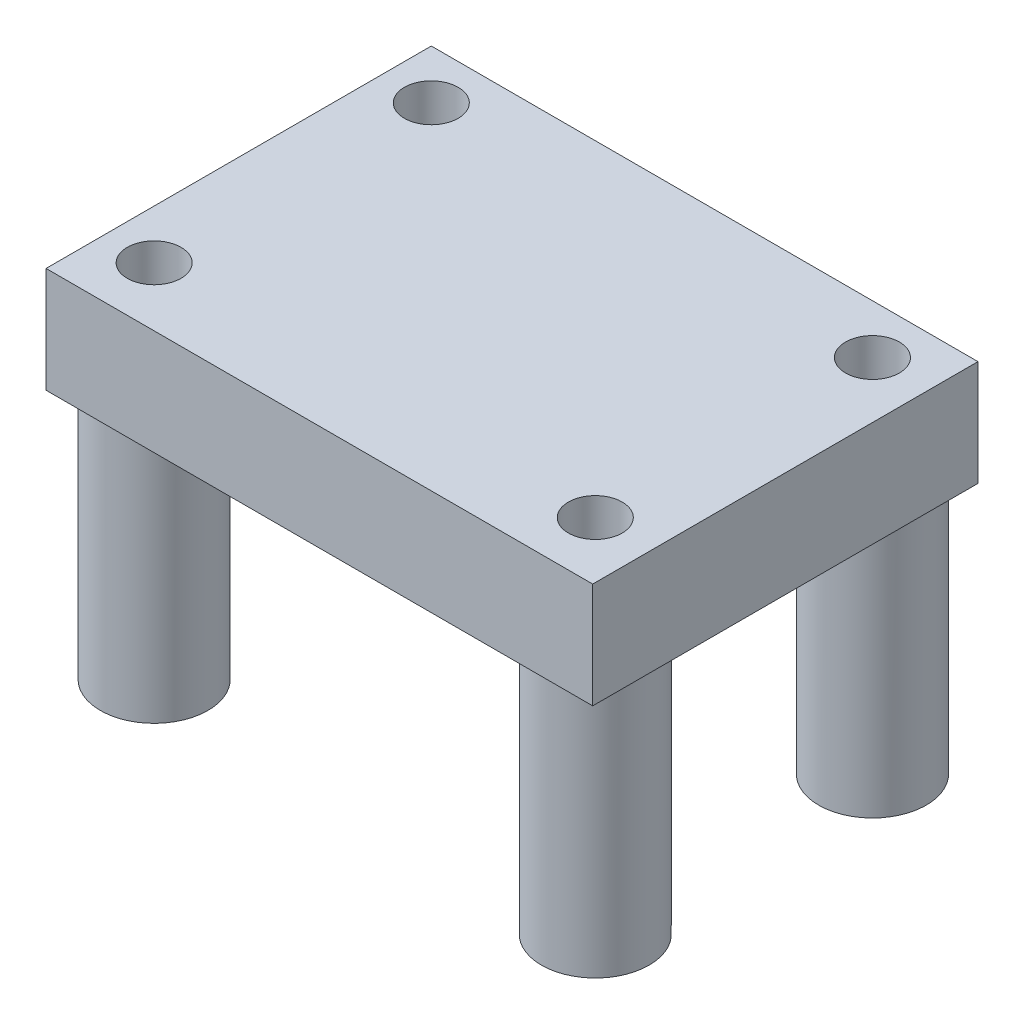
ISO-10303-21;
HEADER;
FILE_DESCRIPTION(('STEP AP214'),'2;1');
FILE_NAME('part.step','',(''),(''),'','','');
FILE_SCHEMA(('AUTOMOTIVE_DESIGN { 1 0 10303 214 1 1 1 1 }'));
ENDSEC;
DATA;
#1=APPLICATION_CONTEXT('core data for automotive mechanical design processes');
#2=APPLICATION_PROTOCOL_DEFINITION('international standard','automotive_design',2000,#1);
#3=PRODUCT_CONTEXT('',#1,'mechanical');
#4=PRODUCT('Part','Part','',(#3));
#5=PRODUCT_RELATED_PRODUCT_CATEGORY('part','',(#4));
#6=PRODUCT_DEFINITION_FORMATION('','',#4);
#7=PRODUCT_DEFINITION_CONTEXT('part definition',#1,'design');
#8=PRODUCT_DEFINITION('design','',#6,#7);
#9=PRODUCT_DEFINITION_SHAPE('','',#8);
#10=(LENGTH_UNIT() NAMED_UNIT(*) SI_UNIT(.MILLI.,.METRE.));
#11=(NAMED_UNIT(*) PLANE_ANGLE_UNIT() SI_UNIT($,.RADIAN.));
#12=(NAMED_UNIT(*) SI_UNIT($,.STERADIAN.) SOLID_ANGLE_UNIT());
#13=UNCERTAINTY_MEASURE_WITH_UNIT(LENGTH_MEASURE(1.E-05),#10,'distance_accuracy_value','');
#14=(GEOMETRIC_REPRESENTATION_CONTEXT(3) GLOBAL_UNCERTAINTY_ASSIGNED_CONTEXT((#13)) GLOBAL_UNIT_ASSIGNED_CONTEXT((#10,
#11,#12)) REPRESENTATION_CONTEXT('',''));
#15=CARTESIAN_POINT('',(0.,0.,0.));
#16=DIRECTION('',(0.,0.,1.));
#17=DIRECTION('',(1.,0.,0.));
#18=AXIS2_PLACEMENT_3D('',#15,#16,#17);
#19=CARTESIAN_POINT('',(0.,0.,0.));
#20=DIRECTION('',(0.,1.,0.));
#21=DIRECTION('',(0.,0.,1.));
#22=AXIS2_PLACEMENT_3D('',#19,#20,#21);
#23=PLANE('',#22);
#24=CARTESIAN_POINT('',(-14.5779448621554,0.,-9.19005739348371));
#25=DIRECTION('',(0.,1.,0.));
#26=DIRECTION('',(0.,0.,1.));
#27=AXIS2_PLACEMENT_3D('',#24,#25,#26);
#28=CIRCLE('',#27,2.5);
#29=CARTESIAN_POINT('',(-16.8639448621554,0.,-10.2020870373183));
#30=VERTEX_POINT('',#29);
#31=CARTESIAN_POINT('',(-15.58997450599,0.,-11.4760573934837));
#32=VERTEX_POINT('',#31);
#33=EDGE_CURVE('E11',#30,#32,#28,.F.);
#34=ORIENTED_EDGE('',*,*,#33,.F.);
#35=DIRECTION('',(0.,0.,1.));
#36=VECTOR('',#35,1.);
#37=CARTESIAN_POINT('',(-16.8639448621554,0.,-11.4760573934837));
#38=LINE('',#37,#36);
#39=CARTESIAN_POINT('',(-16.8639448621554,0.,-11.4760573934837));
#40=VERTEX_POINT('',#39);
#41=EDGE_CURVE('E107',#40,#30,#38,.T.);
#42=ORIENTED_EDGE('',*,*,#41,.F.);
#43=DIRECTION('',(-1.,0.,0.));
#44=VECTOR('',#43,1.);
#45=CARTESIAN_POINT('',(-16.8639448621554,0.,-11.4760573934837));
#46=LINE('',#45,#44);
#47=EDGE_CURVE('E51',#32,#40,#46,.T.);
#48=ORIENTED_EDGE('',*,*,#47,.F.);
#49=EDGE_LOOP('',(#34,#42,#48));
#50=FACE_BOUND('',#49,.T.);
#51=ADVANCED_FACE('F36',(#50),#23,.F.);
#52=CARTESIAN_POINT('',(-16.8639448621554,4.9022,-11.4760573934837));
#53=DIRECTION('',(1.,0.,0.));
#54=DIRECTION('',(0.,0.,-1.));
#55=AXIS2_PLACEMENT_3D('',#52,#53,#54);
#56=PLANE('',#55);
#57=ORIENTED_EDGE('',*,*,#41,.T.);
#58=CARTESIAN_POINT('',(-16.8639448621554,0.,-8.1780277496491));
#59=VERTEX_POINT('',#58);
#60=EDGE_CURVE('E103',#30,#59,#38,.T.);
#61=ORIENTED_EDGE('',*,*,#60,.T.);
#62=CARTESIAN_POINT('',(-16.8639448621554,0.,2.67571296268168));
#63=VERTEX_POINT('',#62);
#64=EDGE_CURVE('E104',#59,#63,#38,.T.);
#65=ORIENTED_EDGE('',*,*,#64,.T.);
#66=CARTESIAN_POINT('',(-16.8639448621554,0.,4.6997722503509));
#67=VERTEX_POINT('',#66);
#68=EDGE_CURVE('E119',#63,#67,#38,.T.);
#69=ORIENTED_EDGE('',*,*,#68,.T.);
#70=CARTESIAN_POINT('',(-16.8639448621554,0.,6.42394260651629));
#71=VERTEX_POINT('',#70);
#72=EDGE_CURVE('E112',#67,#71,#38,.T.);
#73=ORIENTED_EDGE('',*,*,#72,.T.);
#74=DIRECTION('',(0.,-1.,0.));
#75=VECTOR('',#74,1.);
#76=CARTESIAN_POINT('',(-16.8639448621554,4.9022,6.42394260651629));
#77=LINE('',#76,#75);
#78=CARTESIAN_POINT('',(-16.8639448621554,4.9022,6.42394260651629));
#79=VERTEX_POINT('',#78);
#80=EDGE_CURVE('E180',#79,#71,#77,.T.);
#81=ORIENTED_EDGE('',*,*,#80,.F.);
#82=DIRECTION('',(0.,0.,1.));
#83=VECTOR('',#82,1.);
#84=CARTESIAN_POINT('',(-16.8639448621554,4.9022,-11.4760573934837));
#85=LINE('',#84,#83);
#86=CARTESIAN_POINT('',(-16.8639448621554,4.9022,-11.4760573934837));
#87=VERTEX_POINT('',#86);
#88=EDGE_CURVE('E155',#87,#79,#85,.T.);
#89=ORIENTED_EDGE('',*,*,#88,.F.);
#90=DIRECTION('',(0.,-1.,0.));
#91=VECTOR('',#90,1.);
#92=CARTESIAN_POINT('',(-16.8639448621554,4.9022,-11.4760573934837));
#93=LINE('',#92,#91);
#94=EDGE_CURVE('E164',#87,#40,#93,.T.);
#95=ORIENTED_EDGE('',*,*,#94,.T.);
#96=EDGE_LOOP('',(#57,#61,#65,#69,#73,#81,#89,#95));
#97=FACE_BOUND('',#96,.T.);
#98=ADVANCED_FACE('F38',(#97),#56,.F.);
#99=CARTESIAN_POINT('',(-16.8639448621554,4.9022,6.42394260651629));
#100=DIRECTION('',(0.,0.,-1.));
#101=DIRECTION('',(-1.,0.,0.));
#102=AXIS2_PLACEMENT_3D('',#99,#100,#101);
#103=PLANE('',#102);
#104=DIRECTION('',(1.,0.,0.));
#105=VECTOR('',#104,1.);
#106=CARTESIAN_POINT('',(-16.8639448621554,0.,6.42394260651629));
#107=LINE('',#106,#105);
#108=CARTESIAN_POINT('',(8.53605513784461,0.,6.42394260651629));
#109=VERTEX_POINT('',#108);
#110=EDGE_CURVE('E166',#71,#109,#107,.T.);
#111=ORIENTED_EDGE('',*,*,#110,.T.);
#112=DIRECTION('',(0.,-1.,0.));
#113=VECTOR('',#112,1.);
#114=CARTESIAN_POINT('',(8.53605513784461,4.9022,6.42394260651629));
#115=LINE('',#114,#113);
#116=CARTESIAN_POINT('',(8.53605513784461,4.9022,6.42394260651629));
#117=VERTEX_POINT('',#116);
#118=EDGE_CURVE('E177',#117,#109,#115,.T.);
#119=ORIENTED_EDGE('',*,*,#118,.F.);
#120=DIRECTION('',(1.,0.,0.));
#121=VECTOR('',#120,1.);
#122=CARTESIAN_POINT('',(-16.8639448621554,4.9022,6.42394260651629));
#123=LINE('',#122,#121);
#124=EDGE_CURVE('E158',#79,#117,#123,.T.);
#125=ORIENTED_EDGE('',*,*,#124,.F.);
#126=ORIENTED_EDGE('',*,*,#80,.T.);
#127=EDGE_LOOP('',(#111,#119,#125,#126));
#128=FACE_BOUND('',#127,.T.);
#129=ADVANCED_FACE('F197',(#128),#103,.F.);
#130=CARTESIAN_POINT('',(8.53605513784461,4.9022,-11.4760573934837));
#131=DIRECTION('',(-1.,0.,0.));
#132=DIRECTION('',(0.,0.,1.));
#133=AXIS2_PLACEMENT_3D('',#130,#131,#132);
#134=PLANE('',#133);
#135=DIRECTION('',(0.,0.,-1.));
#136=VECTOR('',#135,1.);
#137=CARTESIAN_POINT('',(8.53605513784461,0.,-11.4760573934837));
#138=LINE('',#137,#136);
#139=CARTESIAN_POINT('',(8.53605513784461,0.,-11.4760573934837));
#140=VERTEX_POINT('',#139);
#141=EDGE_CURVE('E168',#109,#140,#138,.T.);
#142=ORIENTED_EDGE('',*,*,#141,.T.);
#143=DIRECTION('',(0.,-1.,0.));
#144=VECTOR('',#143,1.);
#145=CARTESIAN_POINT('',(8.53605513784461,4.9022,-11.4760573934837));
#146=LINE('',#145,#144);
#147=CARTESIAN_POINT('',(8.53605513784461,4.9022,-11.4760573934837));
#148=VERTEX_POINT('',#147);
#149=EDGE_CURVE('E174',#148,#140,#146,.T.);
#150=ORIENTED_EDGE('',*,*,#149,.F.);
#151=DIRECTION('',(0.,0.,-1.));
#152=VECTOR('',#151,1.);
#153=CARTESIAN_POINT('',(8.53605513784461,4.9022,-11.4760573934837));
#154=LINE('',#153,#152);
#155=EDGE_CURVE('E161',#117,#148,#154,.T.);
#156=ORIENTED_EDGE('',*,*,#155,.F.);
#157=ORIENTED_EDGE('',*,*,#118,.T.);
#158=EDGE_LOOP('',(#142,#150,#156,#157));
#159=FACE_BOUND('',#158,.T.);
#160=ADVANCED_FACE('F224',(#159),#134,.F.);
#161=CARTESIAN_POINT('',(-16.8639448621554,4.9022,-11.4760573934837));
#162=DIRECTION('',(0.,0.,1.));
#163=DIRECTION('',(1.,0.,0.));
#164=AXIS2_PLACEMENT_3D('',#161,#162,#163);
#165=PLANE('',#164);
#166=CARTESIAN_POINT('',(6.93188478167921,0.,-11.4760573934837));
#167=VERTEX_POINT('',#166);
#168=EDGE_CURVE('E159',#140,#167,#46,.T.);
#169=ORIENTED_EDGE('',*,*,#168,.T.);
#170=CARTESIAN_POINT('',(4.90782549401,0.,-11.4760573934837));
#171=VERTEX_POINT('',#170);
#172=EDGE_CURVE('E172',#167,#171,#46,.T.);
#173=ORIENTED_EDGE('',*,*,#172,.T.);
#174=CARTESIAN_POINT('',(-13.5659152183208,0.,-11.4760573934837));
#175=VERTEX_POINT('',#174);
#176=EDGE_CURVE('E315',#171,#175,#46,.T.);
#177=ORIENTED_EDGE('',*,*,#176,.T.);
#178=EDGE_CURVE('E318',#175,#32,#46,.T.);
#179=ORIENTED_EDGE('',*,*,#178,.T.);
#180=ORIENTED_EDGE('',*,*,#47,.T.);
#181=ORIENTED_EDGE('',*,*,#94,.F.);
#182=DIRECTION('',(-1.,0.,0.));
#183=VECTOR('',#182,1.);
#184=CARTESIAN_POINT('',(-16.8639448621554,4.9022,-11.4760573934837));
#185=LINE('',#184,#183);
#186=EDGE_CURVE('E163',#148,#87,#185,.T.);
#187=ORIENTED_EDGE('',*,*,#186,.F.);
#188=ORIENTED_EDGE('',*,*,#149,.T.);
#189=EDGE_LOOP('',(#169,#173,#177,#179,#180,#181,#187,#188));
#190=FACE_BOUND('',#189,.T.);
#191=ADVANCED_FACE('F219',(#190),#165,.F.);
#192=CARTESIAN_POINT('',(0.,4.9022,0.));
#193=DIRECTION('',(0.,1.,0.));
#194=DIRECTION('',(0.,0.,1.));
#195=AXIS2_PLACEMENT_3D('',#192,#193,#194);
#196=PLANE('',#195);
#197=CARTESIAN_POINT('',(5.91985513784461,4.9022,3.68774260651629));
#198=DIRECTION('',(0.,-1.,0.));
#199=DIRECTION('',(0.,0.,-1.));
#200=AXIS2_PLACEMENT_3D('',#197,#198,#199);
#201=CIRCLE('',#200,1.25);
#202=CARTESIAN_POINT('',(5.91985513784461,4.9022,2.43774260651629));
#203=VERTEX_POINT('',#202);
#204=EDGE_CURVE('E300',#203,#203,#201,.T.);
#205=ORIENTED_EDGE('',*,*,#204,.T.);
#206=EDGE_LOOP('',(#205));
#207=FACE_BOUND('',#206,.T.);
#208=CARTESIAN_POINT('',(5.91985513784461,4.9022,-9.19005739348371));
#209=DIRECTION('',(0.,-1.,0.));
#210=DIRECTION('',(0.,0.,-1.));
#211=AXIS2_PLACEMENT_3D('',#208,#209,#210);
#212=CIRCLE('',#211,1.25);
#213=CARTESIAN_POINT('',(5.91985513784461,4.9022,-10.4400573934837));
#214=VERTEX_POINT('',#213);
#215=EDGE_CURVE('E294',#214,#214,#212,.T.);
#216=ORIENTED_EDGE('',*,*,#215,.T.);
#217=EDGE_LOOP('',(#216));
#218=FACE_BOUND('',#217,.T.);
#219=CARTESIAN_POINT('',(-14.5779448621554,4.9022,-9.19005739348371));
#220=DIRECTION('',(0.,-1.,0.));
#221=DIRECTION('',(0.,0.,-1.));
#222=AXIS2_PLACEMENT_3D('',#219,#220,#221);
#223=CIRCLE('',#222,1.25);
#224=CARTESIAN_POINT('',(-14.5779448621554,4.9022,-10.4400573934837));
#225=VERTEX_POINT('',#224);
#226=EDGE_CURVE('E283',#225,#225,#223,.T.);
#227=ORIENTED_EDGE('',*,*,#226,.T.);
#228=EDGE_LOOP('',(#227));
#229=FACE_BOUND('',#228,.T.);
#230=CARTESIAN_POINT('',(-14.5779448621554,4.9022,3.68774260651629));
#231=DIRECTION('',(0.,-1.,0.));
#232=DIRECTION('',(0.,0.,-1.));
#233=AXIS2_PLACEMENT_3D('',#230,#231,#232);
#234=CIRCLE('',#233,1.25);
#235=CARTESIAN_POINT('',(-14.5779448621554,4.9022,2.43774260651629));
#236=VERTEX_POINT('',#235);
#237=EDGE_CURVE('E136',#236,#236,#234,.T.);
#238=ORIENTED_EDGE('',*,*,#237,.T.);
#239=EDGE_LOOP('',(#238));
#240=FACE_BOUND('',#239,.T.);
#241=ORIENTED_EDGE('',*,*,#88,.T.);
#242=ORIENTED_EDGE('',*,*,#124,.T.);
#243=ORIENTED_EDGE('',*,*,#155,.T.);
#244=ORIENTED_EDGE('',*,*,#186,.T.);
#245=EDGE_LOOP('',(#241,#242,#243,#244));
#246=FACE_BOUND('',#245,.T.);
#247=ADVANCED_FACE('F200',(#207,#218,#229,#240,#246),#196,.T.);
#248=CARTESIAN_POINT('',(-14.5779448621554,0.,-9.19005739348371));
#249=DIRECTION('',(0.,-1.,0.));
#250=DIRECTION('',(0.,0.,-1.));
#251=AXIS2_PLACEMENT_3D('',#248,#249,#250);
#252=CIRCLE('',#251,2.5);
#253=EDGE_CURVE('E59',#175,#59,#252,.T.);
#254=ORIENTED_EDGE('',*,*,#253,.F.);
#255=ORIENTED_EDGE('',*,*,#176,.F.);
#256=CARTESIAN_POINT('',(5.91985513784461,0.,-9.19005739348371));
#257=DIRECTION('',(0.,-1.,0.));
#258=DIRECTION('',(0.,0.,-1.));
#259=AXIS2_PLACEMENT_3D('',#256,#257,#258);
#260=CIRCLE('',#259,2.5);
#261=EDGE_CURVE('E143',#167,#171,#260,.T.);
#262=ORIENTED_EDGE('',*,*,#261,.F.);
#263=ORIENTED_EDGE('',*,*,#168,.F.);
#264=ORIENTED_EDGE('',*,*,#141,.F.);
#265=ORIENTED_EDGE('',*,*,#110,.F.);
#266=ORIENTED_EDGE('',*,*,#72,.F.);
#267=CARTESIAN_POINT('',(-14.5779448621554,0.,3.68774260651629));
#268=DIRECTION('',(0.,-1.,0.));
#269=DIRECTION('',(0.,0.,-1.));
#270=AXIS2_PLACEMENT_3D('',#267,#268,#269);
#271=CIRCLE('',#270,2.5);
#272=EDGE_CURVE('E117',#63,#67,#271,.T.);
#273=ORIENTED_EDGE('',*,*,#272,.F.);
#274=ORIENTED_EDGE('',*,*,#64,.F.);
#275=EDGE_LOOP('',(#254,#255,#262,#263,#264,#265,#266,#273,#274));
#276=FACE_BOUND('',#275,.T.);
#277=CARTESIAN_POINT('',(5.91985513784461,0.,3.68774260651629));
#278=DIRECTION('',(0.,1.,0.));
#279=DIRECTION('',(0.,0.,1.));
#280=AXIS2_PLACEMENT_3D('',#277,#278,#279);
#281=CIRCLE('',#280,2.5);
#282=CARTESIAN_POINT('',(5.91985513784461,0.,6.18774260651629));
#283=VERTEX_POINT('',#282);
#284=EDGE_CURVE('E44',#283,#283,#281,.F.);
#285=ORIENTED_EDGE('',*,*,#284,.F.);
#286=EDGE_LOOP('',(#285));
#287=FACE_BOUND('',#286,.T.);
#288=ADVANCED_FACE('F113',(#276,#287),#23,.F.);
#289=CARTESIAN_POINT('',(-14.5779448621554,-11.8618,3.68774260651629));
#290=DIRECTION('',(0.,1.,0.));
#291=DIRECTION('',(0.,0.,1.));
#292=AXIS2_PLACEMENT_3D('',#289,#290,#291);
#293=CYLINDRICAL_SURFACE('',#292,2.5);
#294=CARTESIAN_POINT('',(-14.5779448621554,-11.8618,3.68774260651629));
#295=DIRECTION('',(0.,-1.,0.));
#296=DIRECTION('',(0.,0.,-1.));
#297=AXIS2_PLACEMENT_3D('',#294,#295,#296);
#298=CIRCLE('',#297,2.5);
#299=CARTESIAN_POINT('',(-14.5779448621554,-11.8618,1.18774260651629));
#300=VERTEX_POINT('',#299);
#301=EDGE_CURVE('E150',#300,#300,#298,.T.);
#302=ORIENTED_EDGE('',*,*,#301,.F.);
#303=EDGE_LOOP('',(#302));
#304=FACE_BOUND('',#303,.T.);
#305=EDGE_CURVE('E149',#67,#63,#271,.T.);
#306=ORIENTED_EDGE('',*,*,#305,.T.);
#307=ORIENTED_EDGE('',*,*,#272,.T.);
#308=EDGE_LOOP('',(#306,#307));
#309=FACE_BOUND('',#308,.T.);
#310=ADVANCED_FACE('F187',(#304,#309),#293,.T.);
#311=CARTESIAN_POINT('',(-14.5779448621554,-11.8618,3.68774260651629));
#312=DIRECTION('',(0.,-1.,0.));
#313=DIRECTION('',(0.,0.,-1.));
#314=AXIS2_PLACEMENT_3D('',#311,#312,#313);
#315=PLANE('',#314);
#316=CARTESIAN_POINT('',(-14.5779448621554,-11.8618,3.68774260651629));
#317=DIRECTION('',(0.,-1.,0.));
#318=DIRECTION('',(0.,0.,-1.));
#319=AXIS2_PLACEMENT_3D('',#316,#317,#318);
#320=CIRCLE('',#319,1.25);
#321=CARTESIAN_POINT('',(-14.5779448621554,-11.8618,2.43774260651629));
#322=VERTEX_POINT('',#321);
#323=EDGE_CURVE('E140',#322,#322,#320,.T.);
#324=ORIENTED_EDGE('',*,*,#323,.F.);
#325=EDGE_LOOP('',(#324));
#326=FACE_BOUND('',#325,.T.);
#327=ORIENTED_EDGE('',*,*,#301,.T.);
#328=EDGE_LOOP('',(#327));
#329=FACE_BOUND('',#328,.T.);
#330=ADVANCED_FACE('F216',(#326,#329),#315,.T.);
#331=CARTESIAN_POINT('',(-14.5779448621554,0.,3.68774260651629));
#332=DIRECTION('',(0.,-1.,0.));
#333=DIRECTION('',(0.,0.,-1.));
#334=AXIS2_PLACEMENT_3D('',#331,#332,#333);
#335=PLANE('',#334);
#336=ORIENTED_EDGE('',*,*,#68,.F.);
#337=ORIENTED_EDGE('',*,*,#305,.F.);
#338=EDGE_LOOP('',(#336,#337));
#339=FACE_BOUND('',#338,.T.);
#340=ADVANCED_FACE('F189',(#339),#335,.F.);
#341=CARTESIAN_POINT('',(5.91985513784461,-11.8618,3.68774260651629));
#342=DIRECTION('',(0.,1.,0.));
#343=DIRECTION('',(0.,0.,1.));
#344=AXIS2_PLACEMENT_3D('',#341,#342,#343);
#345=CYLINDRICAL_SURFACE('',#344,2.5);
#346=CARTESIAN_POINT('',(5.91985513784461,-11.8618,3.68774260651629));
#347=DIRECTION('',(0.,-1.,0.));
#348=DIRECTION('',(0.,0.,-1.));
#349=AXIS2_PLACEMENT_3D('',#346,#347,#348);
#350=CIRCLE('',#349,2.5);
#351=CARTESIAN_POINT('',(5.91985513784461,-11.8618,1.18774260651629));
#352=VERTEX_POINT('',#351);
#353=EDGE_CURVE('E145',#352,#352,#350,.T.);
#354=ORIENTED_EDGE('',*,*,#353,.F.);
#355=EDGE_LOOP('',(#354));
#356=FACE_BOUND('',#355,.T.);
#357=ORIENTED_EDGE('',*,*,#284,.T.);
#358=EDGE_LOOP('',(#357));
#359=FACE_BOUND('',#358,.T.);
#360=ADVANCED_FACE('F230',(#356,#359),#345,.T.);
#361=CARTESIAN_POINT('',(5.91985513784461,-11.8618,3.68774260651629));
#362=DIRECTION('',(0.,-1.,0.));
#363=DIRECTION('',(0.,0.,-1.));
#364=AXIS2_PLACEMENT_3D('',#361,#362,#363);
#365=PLANE('',#364);
#366=CARTESIAN_POINT('',(5.91985513784461,-11.8618,3.68774260651629));
#367=DIRECTION('',(0.,-1.,0.));
#368=DIRECTION('',(0.,0.,-1.));
#369=AXIS2_PLACEMENT_3D('',#366,#367,#368);
#370=CIRCLE('',#369,1.25);
#371=CARTESIAN_POINT('',(5.91985513784461,-11.8618,2.43774260651629));
#372=VERTEX_POINT('',#371);
#373=EDGE_CURVE('E297',#372,#372,#370,.T.);
#374=ORIENTED_EDGE('',*,*,#373,.F.);
#375=EDGE_LOOP('',(#374));
#376=FACE_BOUND('',#375,.T.);
#377=ORIENTED_EDGE('',*,*,#353,.T.);
#378=EDGE_LOOP('',(#377));
#379=FACE_BOUND('',#378,.T.);
#380=ADVANCED_FACE('F234',(#376,#379),#365,.T.);
#381=CARTESIAN_POINT('',(5.91985513784461,0.,-9.19005739348371));
#382=DIRECTION('',(0.,-1.,0.));
#383=DIRECTION('',(0.,0.,-1.));
#384=AXIS2_PLACEMENT_3D('',#381,#382,#383);
#385=PLANE('',#384);
#386=EDGE_CURVE('E130',#171,#167,#260,.T.);
#387=ORIENTED_EDGE('',*,*,#386,.F.);
#388=ORIENTED_EDGE('',*,*,#172,.F.);
#389=EDGE_LOOP('',(#387,#388));
#390=FACE_BOUND('',#389,.T.);
#391=ADVANCED_FACE('F237',(#390),#385,.F.);
#392=CARTESIAN_POINT('',(5.91985513784461,-11.8618,-9.19005739348371));
#393=DIRECTION('',(0.,1.,0.));
#394=DIRECTION('',(0.,0.,1.));
#395=AXIS2_PLACEMENT_3D('',#392,#393,#394);
#396=CYLINDRICAL_SURFACE('',#395,2.5);
#397=CARTESIAN_POINT('',(5.91985513784461,-11.8618,-9.19005739348371));
#398=DIRECTION('',(0.,-1.,0.));
#399=DIRECTION('',(0.,0.,-1.));
#400=AXIS2_PLACEMENT_3D('',#397,#398,#399);
#401=CIRCLE('',#400,2.5);
#402=CARTESIAN_POINT('',(5.91985513784461,-11.8618,-11.6900573934837));
#403=VERTEX_POINT('',#402);
#404=EDGE_CURVE('E128',#403,#403,#401,.T.);
#405=ORIENTED_EDGE('',*,*,#404,.F.);
#406=EDGE_LOOP('',(#405));
#407=FACE_BOUND('',#406,.T.);
#408=ORIENTED_EDGE('',*,*,#261,.T.);
#409=ORIENTED_EDGE('',*,*,#386,.T.);
#410=EDGE_LOOP('',(#408,#409));
#411=FACE_BOUND('',#410,.T.);
#412=ADVANCED_FACE('F245',(#407,#411),#396,.T.);
#413=CARTESIAN_POINT('',(5.91985513784461,-11.8618,-9.19005739348371));
#414=DIRECTION('',(0.,-1.,0.));
#415=DIRECTION('',(0.,0.,-1.));
#416=AXIS2_PLACEMENT_3D('',#413,#414,#415);
#417=PLANE('',#416);
#418=CARTESIAN_POINT('',(5.91985513784461,-11.8618,-9.19005739348371));
#419=DIRECTION('',(0.,-1.,0.));
#420=DIRECTION('',(0.,0.,-1.));
#421=AXIS2_PLACEMENT_3D('',#418,#419,#420);
#422=CIRCLE('',#421,1.25);
#423=CARTESIAN_POINT('',(5.91985513784461,-11.8618,-10.4400573934837));
#424=VERTEX_POINT('',#423);
#425=EDGE_CURVE('E289',#424,#424,#422,.T.);
#426=ORIENTED_EDGE('',*,*,#425,.F.);
#427=EDGE_LOOP('',(#426));
#428=FACE_BOUND('',#427,.T.);
#429=ORIENTED_EDGE('',*,*,#404,.T.);
#430=EDGE_LOOP('',(#429));
#431=FACE_BOUND('',#430,.T.);
#432=ADVANCED_FACE('F242',(#428,#431),#417,.T.);
#433=CARTESIAN_POINT('',(-14.5779448621554,0.,-9.19005739348371));
#434=DIRECTION('',(0.,-1.,0.));
#435=DIRECTION('',(0.,0.,-1.));
#436=AXIS2_PLACEMENT_3D('',#433,#434,#435);
#437=PLANE('',#436);
#438=EDGE_CURVE('E120',#59,#30,#252,.T.);
#439=ORIENTED_EDGE('',*,*,#438,.F.);
#440=ORIENTED_EDGE('',*,*,#60,.F.);
#441=EDGE_LOOP('',(#439,#440));
#442=FACE_BOUND('',#441,.T.);
#443=ADVANCED_FACE('F121',(#442),#437,.F.);
#444=EDGE_CURVE('E123',#32,#175,#252,.T.);
#445=ORIENTED_EDGE('',*,*,#444,.F.);
#446=ORIENTED_EDGE('',*,*,#178,.F.);
#447=EDGE_LOOP('',(#445,#446));
#448=FACE_BOUND('',#447,.T.);
#449=ADVANCED_FACE('F260',(#448),#437,.F.);
#450=CARTESIAN_POINT('',(-14.5779448621554,-11.8618,-9.19005739348371));
#451=DIRECTION('',(0.,1.,0.));
#452=DIRECTION('',(0.,0.,1.));
#453=AXIS2_PLACEMENT_3D('',#450,#451,#452);
#454=CYLINDRICAL_SURFACE('',#453,2.5);
#455=CARTESIAN_POINT('',(-14.5779448621554,-11.8618,-9.19005739348371));
#456=DIRECTION('',(0.,-1.,0.));
#457=DIRECTION('',(0.,0.,-1.));
#458=AXIS2_PLACEMENT_3D('',#455,#456,#457);
#459=CIRCLE('',#458,2.5);
#460=CARTESIAN_POINT('',(-14.5779448621554,-11.8618,-11.6900573934837));
#461=VERTEX_POINT('',#460);
#462=EDGE_CURVE('E134',#461,#461,#459,.T.);
#463=ORIENTED_EDGE('',*,*,#462,.F.);
#464=EDGE_LOOP('',(#463));
#465=FACE_BOUND('',#464,.T.);
#466=ORIENTED_EDGE('',*,*,#253,.T.);
#467=ORIENTED_EDGE('',*,*,#438,.T.);
#468=ORIENTED_EDGE('',*,*,#33,.T.);
#469=ORIENTED_EDGE('',*,*,#444,.T.);
#470=EDGE_LOOP('',(#466,#467,#468,#469));
#471=FACE_BOUND('',#470,.T.);
#472=ADVANCED_FACE('F126',(#465,#471),#454,.T.);
#473=CARTESIAN_POINT('',(-14.5779448621554,-11.8618,-9.19005739348371));
#474=DIRECTION('',(0.,-1.,0.));
#475=DIRECTION('',(0.,0.,-1.));
#476=AXIS2_PLACEMENT_3D('',#473,#474,#475);
#477=PLANE('',#476);
#478=CARTESIAN_POINT('',(-14.5779448621554,-11.8618,-9.19005739348371));
#479=DIRECTION('',(0.,-1.,0.));
#480=DIRECTION('',(0.,0.,-1.));
#481=AXIS2_PLACEMENT_3D('',#478,#479,#480);
#482=CIRCLE('',#481,1.25);
#483=CARTESIAN_POINT('',(-14.5779448621554,-11.8618,-10.4400573934837));
#484=VERTEX_POINT('',#483);
#485=EDGE_CURVE('E286',#484,#484,#482,.T.);
#486=ORIENTED_EDGE('',*,*,#485,.F.);
#487=EDGE_LOOP('',(#486));
#488=FACE_BOUND('',#487,.T.);
#489=ORIENTED_EDGE('',*,*,#462,.T.);
#490=EDGE_LOOP('',(#489));
#491=FACE_BOUND('',#490,.T.);
#492=ADVANCED_FACE('F253',(#488,#491),#477,.T.);
#493=CARTESIAN_POINT('',(-14.5779448621554,4.9022,-9.19005739348371));
#494=DIRECTION('',(0.,-1.,0.));
#495=DIRECTION('',(0.,0.,-1.));
#496=AXIS2_PLACEMENT_3D('',#493,#494,#495);
#497=CYLINDRICAL_SURFACE('',#496,1.25);
#498=ORIENTED_EDGE('',*,*,#226,.F.);
#499=EDGE_LOOP('',(#498));
#500=FACE_BOUND('',#499,.T.);
#501=ORIENTED_EDGE('',*,*,#485,.T.);
#502=EDGE_LOOP('',(#501));
#503=FACE_BOUND('',#502,.T.);
#504=ADVANCED_FACE('F256',(#500,#503),#497,.F.);
#505=CARTESIAN_POINT('',(5.91985513784461,4.9022,-9.19005739348371));
#506=DIRECTION('',(0.,-1.,0.));
#507=DIRECTION('',(0.,0.,-1.));
#508=AXIS2_PLACEMENT_3D('',#505,#506,#507);
#509=CYLINDRICAL_SURFACE('',#508,1.25);
#510=ORIENTED_EDGE('',*,*,#215,.F.);
#511=EDGE_LOOP('',(#510));
#512=FACE_BOUND('',#511,.T.);
#513=ORIENTED_EDGE('',*,*,#425,.T.);
#514=EDGE_LOOP('',(#513));
#515=FACE_BOUND('',#514,.T.);
#516=ADVANCED_FACE('F271',(#512,#515),#509,.F.);
#517=CARTESIAN_POINT('',(5.91985513784461,4.9022,3.68774260651629));
#518=DIRECTION('',(0.,-1.,0.));
#519=DIRECTION('',(0.,0.,-1.));
#520=AXIS2_PLACEMENT_3D('',#517,#518,#519);
#521=CYLINDRICAL_SURFACE('',#520,1.25);
#522=ORIENTED_EDGE('',*,*,#204,.F.);
#523=EDGE_LOOP('',(#522));
#524=FACE_BOUND('',#523,.T.);
#525=ORIENTED_EDGE('',*,*,#373,.T.);
#526=EDGE_LOOP('',(#525));
#527=FACE_BOUND('',#526,.T.);
#528=ADVANCED_FACE('F267',(#524,#527),#521,.F.);
#529=CARTESIAN_POINT('',(-14.5779448621554,4.9022,3.68774260651629));
#530=DIRECTION('',(0.,-1.,0.));
#531=DIRECTION('',(0.,0.,-1.));
#532=AXIS2_PLACEMENT_3D('',#529,#530,#531);
#533=CYLINDRICAL_SURFACE('',#532,1.25);
#534=ORIENTED_EDGE('',*,*,#237,.F.);
#535=EDGE_LOOP('',(#534));
#536=FACE_BOUND('',#535,.T.);
#537=ORIENTED_EDGE('',*,*,#323,.T.);
#538=EDGE_LOOP('',(#537));
#539=FACE_BOUND('',#538,.T.);
#540=ADVANCED_FACE('F264',(#536,#539),#533,.F.);
#541=CLOSED_SHELL('',(#51,#98,#129,#160,#191,#247,#288,#310,#330,#340,#360,#380,#391,#412,#432,
#443,#449,#472,#492,#504,#516,#528,#540));
#542=MANIFOLD_SOLID_BREP('B2',#541);
#543=ADVANCED_BREP_SHAPE_REPRESENTATION('',(#18,#542),#14);
#544=SHAPE_DEFINITION_REPRESENTATION(#9,#543);
ENDSEC;
END-ISO-10303-21;
